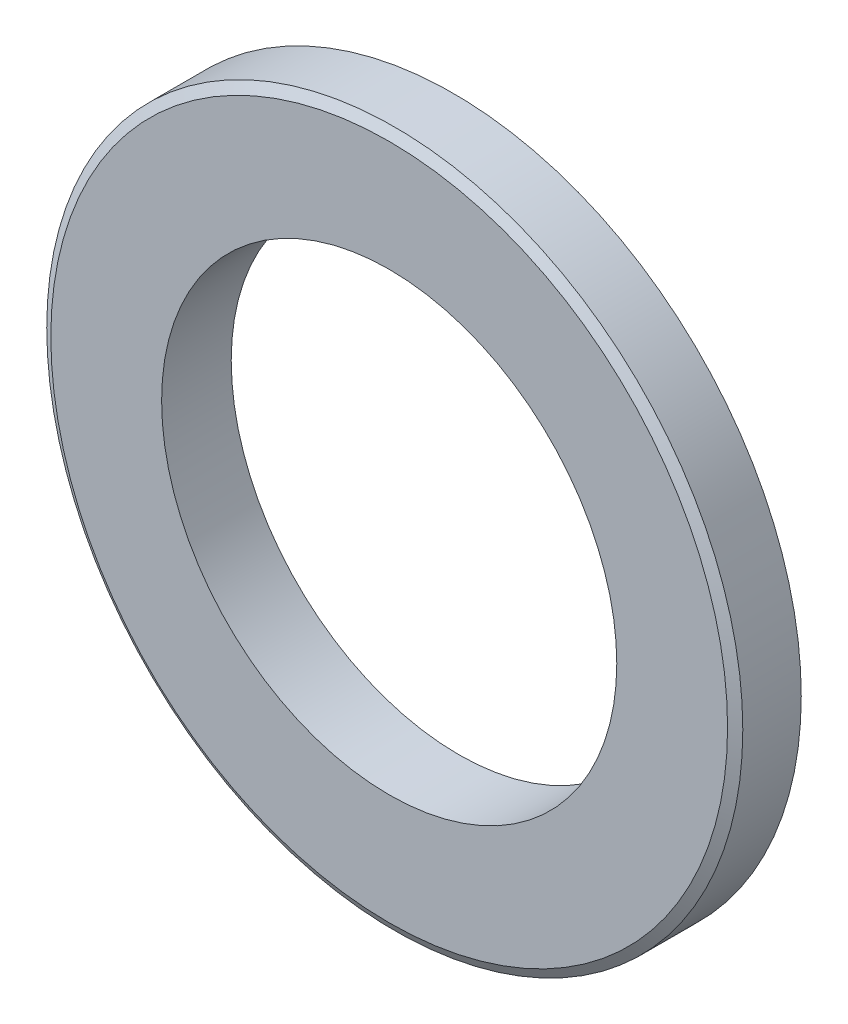
ISO-10303-21;
HEADER;
FILE_DESCRIPTION(('STEP AP214'),'2;1');
FILE_NAME('part.step','',(''),(''),'','','');
FILE_SCHEMA(('AUTOMOTIVE_DESIGN { 1 0 10303 214 1 1 1 1 }'));
ENDSEC;
DATA;
#1=APPLICATION_CONTEXT('core data for automotive mechanical design processes');
#2=APPLICATION_PROTOCOL_DEFINITION('international standard','automotive_design',2000,#1);
#3=PRODUCT_CONTEXT('',#1,'mechanical');
#4=PRODUCT('Part','Part','',(#3));
#5=PRODUCT_RELATED_PRODUCT_CATEGORY('part','',(#4));
#6=PRODUCT_DEFINITION_FORMATION('','',#4);
#7=PRODUCT_DEFINITION_CONTEXT('part definition',#1,'design');
#8=PRODUCT_DEFINITION('design','',#6,#7);
#9=PRODUCT_DEFINITION_SHAPE('','',#8);
#10=(LENGTH_UNIT() NAMED_UNIT(*) SI_UNIT(.MILLI.,.METRE.));
#11=(NAMED_UNIT(*) PLANE_ANGLE_UNIT() SI_UNIT($,.RADIAN.));
#12=(NAMED_UNIT(*) SI_UNIT($,.STERADIAN.) SOLID_ANGLE_UNIT());
#13=UNCERTAINTY_MEASURE_WITH_UNIT(LENGTH_MEASURE(1.E-05),#10,'distance_accuracy_value','');
#14=(GEOMETRIC_REPRESENTATION_CONTEXT(3) GLOBAL_UNCERTAINTY_ASSIGNED_CONTEXT((#13)) GLOBAL_UNIT_ASSIGNED_CONTEXT((#10,
#11,#12)) REPRESENTATION_CONTEXT('',''));
#15=CARTESIAN_POINT('',(0.,0.,0.));
#16=DIRECTION('',(0.,0.,1.));
#17=DIRECTION('',(1.,0.,0.));
#18=AXIS2_PLACEMENT_3D('',#15,#16,#17);
#19=CARTESIAN_POINT('',(0.,0.,1.5875));
#20=DIRECTION('',(0.,0.,1.));
#21=DIRECTION('',(1.,0.,0.));
#22=AXIS2_PLACEMENT_3D('',#19,#20,#21);
#23=PLANE('',#22);
#24=CARTESIAN_POINT('',(0.,0.,1.5875));
#25=DIRECTION('',(0.,0.,1.));
#26=DIRECTION('',(1.,0.,0.));
#27=AXIS2_PLACEMENT_3D('',#24,#25,#26);
#28=CIRCLE('',#27,10.380999939);
#29=CARTESIAN_POINT('',(10.380999939,0.,1.5875));
#30=VERTEX_POINT('',#29);
#31=EDGE_CURVE('E66',#30,#30,#28,.T.);
#32=ORIENTED_EDGE('',*,*,#31,.F.);
#33=EDGE_LOOP('',(#32));
#34=FACE_BOUND('',#33,.T.);
#35=CARTESIAN_POINT('',(0.,0.,1.5875));
#36=DIRECTION('',(0.,0.,1.));
#37=DIRECTION('',(1.,0.,0.));
#38=AXIS2_PLACEMENT_3D('',#35,#36,#37);
#39=CIRCLE('',#38,15.4350590948775);
#40=CARTESIAN_POINT('',(15.4350590948775,0.,1.5875));
#41=VERTEX_POINT('',#40);
#42=EDGE_CURVE('E10',#41,#41,#39,.T.);
#43=ORIENTED_EDGE('',*,*,#42,.T.);
#44=EDGE_LOOP('',(#43));
#45=FACE_BOUND('',#44,.T.);
#46=ADVANCED_FACE('F45',(#34,#45),#23,.T.);
#47=CARTESIAN_POINT('',(0.,0.,1.5875));
#48=DIRECTION('',(0.,0.,-1.));
#49=DIRECTION('',(-1.,0.,0.));
#50=AXIS2_PLACEMENT_3D('',#47,#48,#49);
#51=CYLINDRICAL_SURFACE('',#50,15.875);
#52=CARTESIAN_POINT('',(0.,0.,-1.33350000000002));
#53=DIRECTION('',(0.,0.,1.));
#54=DIRECTION('',(1.,0.,0.));
#55=AXIS2_PLACEMENT_3D('',#52,#53,#54);
#56=CIRCLE('',#55,15.875);
#57=CARTESIAN_POINT('',(15.875,0.,-1.33350000000002));
#58=VERTEX_POINT('',#57);
#59=EDGE_CURVE('E56',#58,#58,#56,.T.);
#60=ORIENTED_EDGE('',*,*,#59,.T.);
#61=EDGE_LOOP('',(#60));
#62=FACE_BOUND('',#61,.T.);
#63=CARTESIAN_POINT('',(0.,0.,1.33350000000001));
#64=DIRECTION('',(0.,0.,1.));
#65=DIRECTION('',(1.,0.,0.));
#66=AXIS2_PLACEMENT_3D('',#63,#64,#65);
#67=CIRCLE('',#66,15.875);
#68=CARTESIAN_POINT('',(15.875,0.,1.33350000000001));
#69=VERTEX_POINT('',#68);
#70=EDGE_CURVE('E60',#69,#69,#67,.F.);
#71=ORIENTED_EDGE('',*,*,#70,.T.);
#72=EDGE_LOOP('',(#71));
#73=FACE_BOUND('',#72,.T.);
#74=ADVANCED_FACE('F81',(#62,#73),#51,.T.);
#75=CARTESIAN_POINT('',(0.,0.,-1.5875));
#76=DIRECTION('',(0.,0.,1.));
#77=DIRECTION('',(1.,0.,0.));
#78=AXIS2_PLACEMENT_3D('',#75,#76,#77);
#79=PLANE('',#78);
#80=CARTESIAN_POINT('',(0.,0.,-1.5875));
#81=DIRECTION('',(0.,0.,1.));
#82=DIRECTION('',(1.,0.,0.));
#83=AXIS2_PLACEMENT_3D('',#80,#81,#82);
#84=CIRCLE('',#83,10.380999939);
#85=CARTESIAN_POINT('',(10.380999939,0.,-1.5875));
#86=VERTEX_POINT('',#85);
#87=EDGE_CURVE('E65',#86,#86,#84,.T.);
#88=ORIENTED_EDGE('',*,*,#87,.T.);
#89=EDGE_LOOP('',(#88));
#90=FACE_BOUND('',#89,.T.);
#91=CARTESIAN_POINT('',(0.,0.,-1.5875));
#92=DIRECTION('',(0.,0.,1.));
#93=DIRECTION('',(1.,0.,0.));
#94=AXIS2_PLACEMENT_3D('',#91,#92,#93);
#95=CIRCLE('',#94,15.4350590948775);
#96=CARTESIAN_POINT('',(15.4350590948775,0.,-1.5875));
#97=VERTEX_POINT('',#96);
#98=EDGE_CURVE('E52',#97,#97,#95,.F.);
#99=ORIENTED_EDGE('',*,*,#98,.T.);
#100=EDGE_LOOP('',(#99));
#101=FACE_BOUND('',#100,.T.);
#102=ADVANCED_FACE('F72',(#90,#101),#79,.F.);
#103=CARTESIAN_POINT('',(0.,0.,-1.33350000000002));
#104=DIRECTION('',(0.,0.,1.));
#105=DIRECTION('',(1.,0.,0.));
#106=AXIS2_PLACEMENT_3D('',#103,#104,#105);
#107=CONICAL_SURFACE('',#106,15.875,1.0471975511966);
#108=ORIENTED_EDGE('',*,*,#98,.F.);
#109=EDGE_LOOP('',(#108));
#110=FACE_BOUND('',#109,.T.);
#111=ORIENTED_EDGE('',*,*,#59,.F.);
#112=EDGE_LOOP('',(#111));
#113=FACE_BOUND('',#112,.T.);
#114=ADVANCED_FACE('F91',(#110,#113),#107,.T.);
#115=CARTESIAN_POINT('',(0.,0.,1.5875));
#116=DIRECTION('',(0.,0.,-1.));
#117=DIRECTION('',(-1.,0.,0.));
#118=AXIS2_PLACEMENT_3D('',#115,#116,#117);
#119=CONICAL_SURFACE('',#118,15.4350590948775,1.0471975511966);
#120=ORIENTED_EDGE('',*,*,#70,.F.);
#121=EDGE_LOOP('',(#120));
#122=FACE_BOUND('',#121,.T.);
#123=ORIENTED_EDGE('',*,*,#42,.F.);
#124=EDGE_LOOP('',(#123));
#125=FACE_BOUND('',#124,.T.);
#126=ADVANCED_FACE('F47',(#122,#125),#119,.T.);
#127=CARTESIAN_POINT('',(0.,0.,-1.5875));
#128=DIRECTION('',(0.,0.,1.));
#129=DIRECTION('',(1.,0.,0.));
#130=AXIS2_PLACEMENT_3D('',#127,#128,#129);
#131=CYLINDRICAL_SURFACE('',#130,10.380999939);
#132=ORIENTED_EDGE('',*,*,#87,.F.);
#133=EDGE_LOOP('',(#132));
#134=FACE_BOUND('',#133,.T.);
#135=ORIENTED_EDGE('',*,*,#31,.T.);
#136=EDGE_LOOP('',(#135));
#137=FACE_BOUND('',#136,.T.);
#138=ADVANCED_FACE('F74',(#134,#137),#131,.F.);
#139=CLOSED_SHELL('',(#46,#74,#102,#114,#126,#138));
#140=MANIFOLD_SOLID_BREP('B2',#139);
#141=ADVANCED_BREP_SHAPE_REPRESENTATION('',(#18,#140),#14);
#142=SHAPE_DEFINITION_REPRESENTATION(#9,#141);
ENDSEC;
END-ISO-10303-21;
